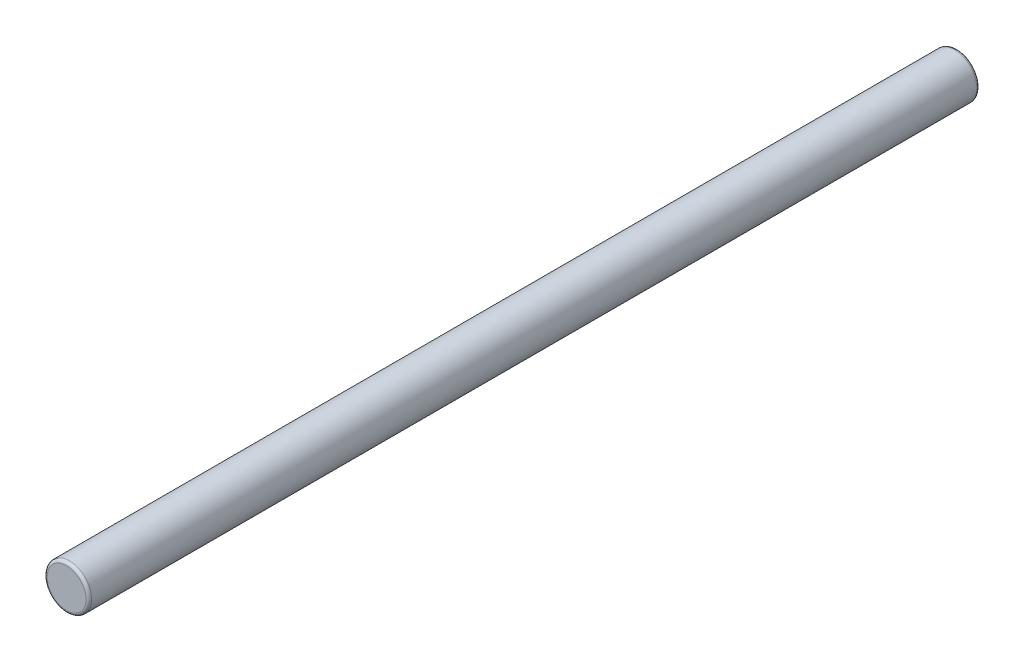
ISO-10303-21;
HEADER;
FILE_DESCRIPTION(('STEP AP214'),'2;1');
FILE_NAME('part.step','',(''),(''),'','','');
FILE_SCHEMA(('AUTOMOTIVE_DESIGN { 1 0 10303 214 1 1 1 1 }'));
ENDSEC;
DATA;
#1=APPLICATION_CONTEXT('core data for automotive mechanical design processes');
#2=APPLICATION_PROTOCOL_DEFINITION('international standard','automotive_design',2000,#1);
#3=PRODUCT_CONTEXT('',#1,'mechanical');
#4=PRODUCT('Part','Part','',(#3));
#5=PRODUCT_RELATED_PRODUCT_CATEGORY('part','',(#4));
#6=PRODUCT_DEFINITION_FORMATION('','',#4);
#7=PRODUCT_DEFINITION_CONTEXT('part definition',#1,'design');
#8=PRODUCT_DEFINITION('design','',#6,#7);
#9=PRODUCT_DEFINITION_SHAPE('','',#8);
#10=(LENGTH_UNIT() NAMED_UNIT(*) SI_UNIT(.MILLI.,.METRE.));
#11=(NAMED_UNIT(*) PLANE_ANGLE_UNIT() SI_UNIT($,.RADIAN.));
#12=(NAMED_UNIT(*) SI_UNIT($,.STERADIAN.) SOLID_ANGLE_UNIT());
#13=UNCERTAINTY_MEASURE_WITH_UNIT(LENGTH_MEASURE(1.E-05),#10,'distance_accuracy_value','');
#14=(GEOMETRIC_REPRESENTATION_CONTEXT(3) GLOBAL_UNCERTAINTY_ASSIGNED_CONTEXT((#13)) GLOBAL_UNIT_ASSIGNED_CONTEXT((#10,
#11,#12)) REPRESENTATION_CONTEXT('',''));
#15=CARTESIAN_POINT('',(0.,0.,0.));
#16=DIRECTION('',(0.,0.,1.));
#17=DIRECTION('',(1.,0.,0.));
#18=AXIS2_PLACEMENT_3D('',#15,#16,#17);
#19=CARTESIAN_POINT('',(0.,0.,20.));
#20=DIRECTION('',(0.,0.,-1.));
#21=DIRECTION('',(-1.,0.,0.));
#22=AXIS2_PLACEMENT_3D('',#19,#20,#21);
#23=CYLINDRICAL_SURFACE('',#22,0.999999999999999);
#24=CARTESIAN_POINT('',(0.,0.,-19.873));
#25=DIRECTION('',(0.,0.,1.));
#26=DIRECTION('',(1.,0.,0.));
#27=AXIS2_PLACEMENT_3D('',#24,#25,#26);
#28=CIRCLE('',#27,0.999999999999999);
#29=CARTESIAN_POINT('',(0.999999999999999,0.,-19.873));
#30=VERTEX_POINT('',#29);
#31=EDGE_CURVE('E43',#30,#30,#28,.T.);
#32=ORIENTED_EDGE('',*,*,#31,.T.);
#33=EDGE_LOOP('',(#32));
#34=FACE_BOUND('',#33,.T.);
#35=CARTESIAN_POINT('',(0.,0.,19.873));
#36=DIRECTION('',(0.,0.,1.));
#37=DIRECTION('',(1.,0.,0.));
#38=AXIS2_PLACEMENT_3D('',#35,#36,#37);
#39=CIRCLE('',#38,0.999999999999999);
#40=CARTESIAN_POINT('',(0.999999999999999,0.,19.873));
#41=VERTEX_POINT('',#40);
#42=EDGE_CURVE('E47',#41,#41,#39,.F.);
#43=ORIENTED_EDGE('',*,*,#42,.T.);
#44=EDGE_LOOP('',(#43));
#45=FACE_BOUND('',#44,.T.);
#46=ADVANCED_FACE('F32',(#34,#45),#23,.T.);
#47=CARTESIAN_POINT('',(0.,0.,20.));
#48=DIRECTION('',(0.,0.,1.));
#49=DIRECTION('',(1.,0.,0.));
#50=AXIS2_PLACEMENT_3D('',#47,#48,#49);
#51=PLANE('',#50);
#52=CARTESIAN_POINT('',(0.,0.,20.));
#53=DIRECTION('',(0.,0.,1.));
#54=DIRECTION('',(1.,0.,0.));
#55=AXIS2_PLACEMENT_3D('',#52,#53,#54);
#56=CIRCLE('',#55,0.872999999999999);
#57=CARTESIAN_POINT('',(0.872999999999999,0.,20.));
#58=VERTEX_POINT('',#57);
#59=EDGE_CURVE('E10',#58,#58,#56,.T.);
#60=ORIENTED_EDGE('',*,*,#59,.T.);
#61=EDGE_LOOP('',(#60));
#62=FACE_BOUND('',#61,.T.);
#63=ADVANCED_FACE('F63',(#62),#51,.T.);
#64=CARTESIAN_POINT('',(0.,0.,-20.));
#65=DIRECTION('',(0.,0.,1.));
#66=DIRECTION('',(1.,0.,0.));
#67=AXIS2_PLACEMENT_3D('',#64,#65,#66);
#68=PLANE('',#67);
#69=CARTESIAN_POINT('',(0.,0.,-20.));
#70=DIRECTION('',(0.,0.,1.));
#71=DIRECTION('',(1.,0.,0.));
#72=AXIS2_PLACEMENT_3D('',#69,#70,#71);
#73=CIRCLE('',#72,0.872999999999999);
#74=CARTESIAN_POINT('',(0.872999999999999,0.,-20.));
#75=VERTEX_POINT('',#74);
#76=EDGE_CURVE('E39',#75,#75,#73,.F.);
#77=ORIENTED_EDGE('',*,*,#76,.T.);
#78=EDGE_LOOP('',(#77));
#79=FACE_BOUND('',#78,.T.);
#80=ADVANCED_FACE('F60',(#79),#68,.F.);
#81=CARTESIAN_POINT('',(0.,0.,-19.873));
#82=DIRECTION('',(0.,0.,1.));
#83=DIRECTION('',(1.,0.,0.));
#84=AXIS2_PLACEMENT_3D('',#81,#82,#83);
#85=TOROIDAL_SURFACE('',#84,0.872999999999999,0.127);
#86=ORIENTED_EDGE('',*,*,#76,.F.);
#87=EDGE_LOOP('',(#86));
#88=FACE_BOUND('',#87,.T.);
#89=ORIENTED_EDGE('',*,*,#31,.F.);
#90=EDGE_LOOP('',(#89));
#91=FACE_BOUND('',#90,.T.);
#92=ADVANCED_FACE('F56',(#88,#91),#85,.T.);
#93=CARTESIAN_POINT('',(0.,0.,19.873));
#94=DIRECTION('',(0.,0.,1.));
#95=DIRECTION('',(1.,0.,0.));
#96=AXIS2_PLACEMENT_3D('',#93,#94,#95);
#97=TOROIDAL_SURFACE('',#96,0.872999999999999,0.127);
#98=ORIENTED_EDGE('',*,*,#42,.F.);
#99=EDGE_LOOP('',(#98));
#100=FACE_BOUND('',#99,.T.);
#101=ORIENTED_EDGE('',*,*,#59,.F.);
#102=EDGE_LOOP('',(#101));
#103=FACE_BOUND('',#102,.T.);
#104=ADVANCED_FACE('F34',(#100,#103),#97,.T.);
#105=CLOSED_SHELL('',(#46,#63,#80,#92,#104));
#106=MANIFOLD_SOLID_BREP('B2',#105);
#107=ADVANCED_BREP_SHAPE_REPRESENTATION('',(#18,#106),#14);
#108=SHAPE_DEFINITION_REPRESENTATION(#9,#107);
ENDSEC;
END-ISO-10303-21;
